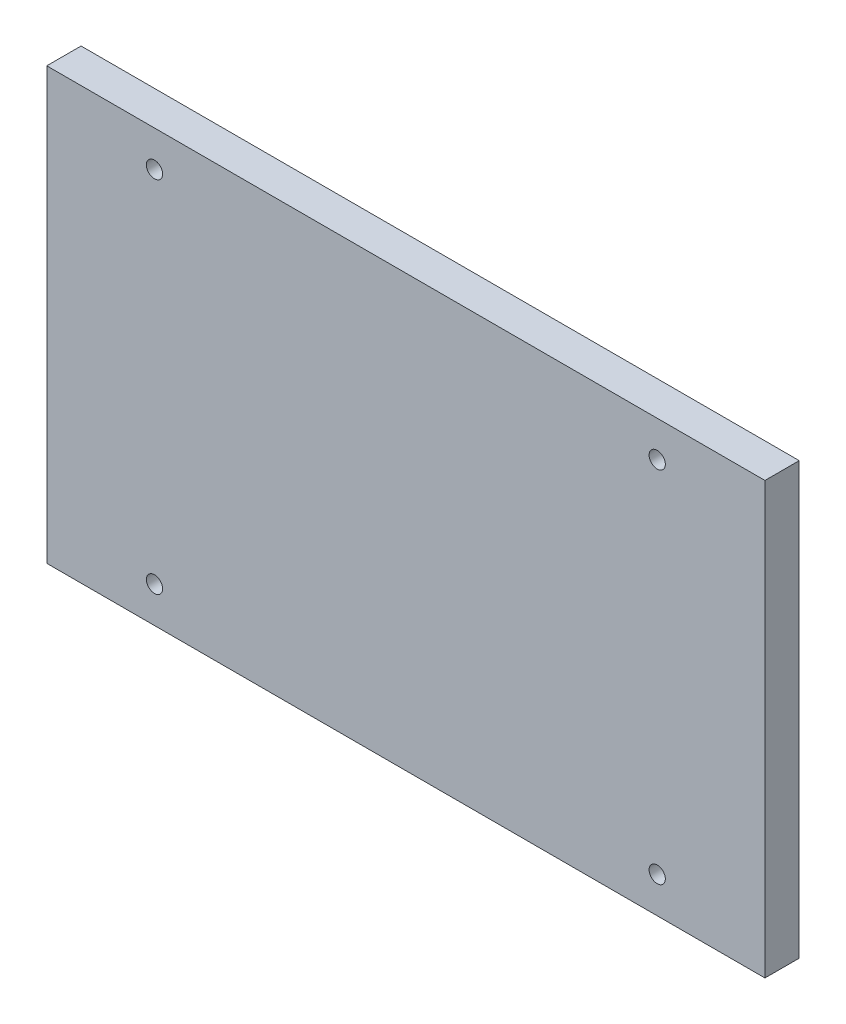
ISO-10303-21;
HEADER;
FILE_DESCRIPTION(('STEP AP214'),'2;1');
FILE_NAME('part.step','',(''),(''),'','','');
FILE_SCHEMA(('AUTOMOTIVE_DESIGN { 1 0 10303 214 1 1 1 1 }'));
ENDSEC;
DATA;
#1=APPLICATION_CONTEXT('core data for automotive mechanical design processes');
#2=APPLICATION_PROTOCOL_DEFINITION('international standard','automotive_design',2000,#1);
#3=PRODUCT_CONTEXT('',#1,'mechanical');
#4=PRODUCT('Part','Part','',(#3));
#5=PRODUCT_RELATED_PRODUCT_CATEGORY('part','',(#4));
#6=PRODUCT_DEFINITION_FORMATION('','',#4);
#7=PRODUCT_DEFINITION_CONTEXT('part definition',#1,'design');
#8=PRODUCT_DEFINITION('design','',#6,#7);
#9=PRODUCT_DEFINITION_SHAPE('','',#8);
#10=(LENGTH_UNIT() NAMED_UNIT(*) SI_UNIT(.MILLI.,.METRE.));
#11=(NAMED_UNIT(*) PLANE_ANGLE_UNIT() SI_UNIT($,.RADIAN.));
#12=(NAMED_UNIT(*) SI_UNIT($,.STERADIAN.) SOLID_ANGLE_UNIT());
#13=UNCERTAINTY_MEASURE_WITH_UNIT(LENGTH_MEASURE(1.E-05),#10,'distance_accuracy_value','');
#14=(GEOMETRIC_REPRESENTATION_CONTEXT(3) GLOBAL_UNCERTAINTY_ASSIGNED_CONTEXT((#13)) GLOBAL_UNIT_ASSIGNED_CONTEXT((#10,
#11,#12)) REPRESENTATION_CONTEXT('',''));
#15=CARTESIAN_POINT('',(0.,0.,0.));
#16=DIRECTION('',(0.,0.,1.));
#17=DIRECTION('',(1.,0.,0.));
#18=AXIS2_PLACEMENT_3D('',#15,#16,#17);
#19=CARTESIAN_POINT('',(100.,0.,4.7752));
#20=DIRECTION('',(1.,0.,0.));
#21=DIRECTION('',(0.,1.,0.));
#22=AXIS2_PLACEMENT_3D('',#19,#20,#21);
#23=PLANE('',#22);
#24=DIRECTION('',(0.,-1.,0.));
#25=VECTOR('',#24,1.);
#26=CARTESIAN_POINT('',(100.,0.,0.));
#27=LINE('',#26,#25);
#28=CARTESIAN_POINT('',(100.,0.,0.));
#29=VERTEX_POINT('',#28);
#30=CARTESIAN_POINT('',(100.,-60.,0.));
#31=VERTEX_POINT('',#30);
#32=EDGE_CURVE('E121',#29,#31,#27,.T.);
#33=ORIENTED_EDGE('',*,*,#32,.F.);
#34=DIRECTION('',(0.,0.,-1.));
#35=VECTOR('',#34,1.);
#36=CARTESIAN_POINT('',(100.,0.,4.7752));
#37=LINE('',#36,#35);
#38=CARTESIAN_POINT('',(100.,0.,4.7752));
#39=VERTEX_POINT('',#38);
#40=EDGE_CURVE('E11',#39,#29,#37,.T.);
#41=ORIENTED_EDGE('',*,*,#40,.F.);
#42=DIRECTION('',(0.,-1.,0.));
#43=VECTOR('',#42,1.);
#44=CARTESIAN_POINT('',(100.,0.,4.7752));
#45=LINE('',#44,#43);
#46=CARTESIAN_POINT('',(100.,-60.,4.7752));
#47=VERTEX_POINT('',#46);
#48=EDGE_CURVE('E112',#39,#47,#45,.T.);
#49=ORIENTED_EDGE('',*,*,#48,.T.);
#50=DIRECTION('',(0.,0.,-1.));
#51=VECTOR('',#50,1.);
#52=CARTESIAN_POINT('',(100.,-60.,4.7752));
#53=LINE('',#52,#51);
#54=EDGE_CURVE('E89',#47,#31,#53,.T.);
#55=ORIENTED_EDGE('',*,*,#54,.T.);
#56=EDGE_LOOP('',(#33,#41,#49,#55));
#57=FACE_BOUND('',#56,.T.);
#58=ADVANCED_FACE('F49',(#57),#23,.T.);
#59=CARTESIAN_POINT('',(0.,0.,4.7752));
#60=DIRECTION('',(0.,1.,0.));
#61=DIRECTION('',(0.,0.,1.));
#62=AXIS2_PLACEMENT_3D('',#59,#60,#61);
#63=PLANE('',#62);
#64=DIRECTION('',(1.,0.,0.));
#65=VECTOR('',#64,1.);
#66=CARTESIAN_POINT('',(0.,0.,0.));
#67=LINE('',#66,#65);
#68=CARTESIAN_POINT('',(0.,0.,0.));
#69=VERTEX_POINT('',#68);
#70=EDGE_CURVE('E101',#69,#29,#67,.T.);
#71=ORIENTED_EDGE('',*,*,#70,.F.);
#72=DIRECTION('',(0.,0.,-1.));
#73=VECTOR('',#72,1.);
#74=CARTESIAN_POINT('',(0.,0.,4.7752));
#75=LINE('',#74,#73);
#76=CARTESIAN_POINT('',(0.,0.,4.7752));
#77=VERTEX_POINT('',#76);
#78=EDGE_CURVE('E58',#77,#69,#75,.T.);
#79=ORIENTED_EDGE('',*,*,#78,.F.);
#80=DIRECTION('',(1.,0.,0.));
#81=VECTOR('',#80,1.);
#82=CARTESIAN_POINT('',(0.,0.,4.7752));
#83=LINE('',#82,#81);
#84=EDGE_CURVE('E99',#77,#39,#83,.T.);
#85=ORIENTED_EDGE('',*,*,#84,.T.);
#86=ORIENTED_EDGE('',*,*,#40,.T.);
#87=EDGE_LOOP('',(#71,#79,#85,#86));
#88=FACE_BOUND('',#87,.T.);
#89=ADVANCED_FACE('F97',(#88),#63,.T.);
#90=CARTESIAN_POINT('',(0.,0.,4.7752));
#91=DIRECTION('',(1.,0.,0.));
#92=DIRECTION('',(0.,1.,0.));
#93=AXIS2_PLACEMENT_3D('',#90,#91,#92);
#94=PLANE('',#93);
#95=DIRECTION('',(0.,-1.,0.));
#96=VECTOR('',#95,1.);
#97=CARTESIAN_POINT('',(0.,0.,0.));
#98=LINE('',#97,#96);
#99=CARTESIAN_POINT('',(0.,-60.,0.));
#100=VERTEX_POINT('',#99);
#101=EDGE_CURVE('E127',#69,#100,#98,.T.);
#102=ORIENTED_EDGE('',*,*,#101,.T.);
#103=DIRECTION('',(0.,0.,-1.));
#104=VECTOR('',#103,1.);
#105=CARTESIAN_POINT('',(0.,-60.,4.7752));
#106=LINE('',#105,#104);
#107=CARTESIAN_POINT('',(0.,-60.,4.7752));
#108=VERTEX_POINT('',#107);
#109=EDGE_CURVE('E105',#108,#100,#106,.T.);
#110=ORIENTED_EDGE('',*,*,#109,.F.);
#111=DIRECTION('',(0.,-1.,0.));
#112=VECTOR('',#111,1.);
#113=CARTESIAN_POINT('',(0.,0.,4.7752));
#114=LINE('',#113,#112);
#115=EDGE_CURVE('E107',#77,#108,#114,.T.);
#116=ORIENTED_EDGE('',*,*,#115,.F.);
#117=ORIENTED_EDGE('',*,*,#78,.T.);
#118=EDGE_LOOP('',(#102,#110,#116,#117));
#119=FACE_BOUND('',#118,.T.);
#120=ADVANCED_FACE('F108',(#119),#94,.F.);
#121=CARTESIAN_POINT('',(0.,-60.,4.7752));
#122=DIRECTION('',(0.,1.,0.));
#123=DIRECTION('',(0.,0.,1.));
#124=AXIS2_PLACEMENT_3D('',#121,#122,#123);
#125=PLANE('',#124);
#126=DIRECTION('',(1.,0.,0.));
#127=VECTOR('',#126,1.);
#128=CARTESIAN_POINT('',(0.,-60.,0.));
#129=LINE('',#128,#127);
#130=EDGE_CURVE('E82',#100,#31,#129,.T.);
#131=ORIENTED_EDGE('',*,*,#130,.T.);
#132=ORIENTED_EDGE('',*,*,#54,.F.);
#133=DIRECTION('',(1.,0.,0.));
#134=VECTOR('',#133,1.);
#135=CARTESIAN_POINT('',(0.,-60.,4.7752));
#136=LINE('',#135,#134);
#137=EDGE_CURVE('E66',#108,#47,#136,.T.);
#138=ORIENTED_EDGE('',*,*,#137,.F.);
#139=ORIENTED_EDGE('',*,*,#109,.T.);
#140=EDGE_LOOP('',(#131,#132,#138,#139));
#141=FACE_BOUND('',#140,.T.);
#142=ADVANCED_FACE('F136',(#141),#125,.F.);
#143=CARTESIAN_POINT('',(0.,0.,4.7752));
#144=DIRECTION('',(0.,0.,1.));
#145=DIRECTION('',(1.,0.,0.));
#146=AXIS2_PLACEMENT_3D('',#143,#144,#145);
#147=PLANE('',#146);
#148=CARTESIAN_POINT('',(15.,-5.,4.7752));
#149=DIRECTION('',(0.,0.,1.));
#150=DIRECTION('',(1.,0.,0.));
#151=AXIS2_PLACEMENT_3D('',#148,#149,#150);
#152=CIRCLE('',#151,1.13029999999999);
#153=CARTESIAN_POINT('',(16.1303,-5.,4.7752));
#154=VERTEX_POINT('',#153);
#155=EDGE_CURVE('E178',#154,#154,#152,.T.);
#156=ORIENTED_EDGE('',*,*,#155,.F.);
#157=EDGE_LOOP('',(#156));
#158=FACE_BOUND('',#157,.T.);
#159=CARTESIAN_POINT('',(15.,-55.,4.7752));
#160=DIRECTION('',(0.,0.,1.));
#161=DIRECTION('',(1.,0.,0.));
#162=AXIS2_PLACEMENT_3D('',#159,#160,#161);
#163=CIRCLE('',#162,1.13029999999999);
#164=CARTESIAN_POINT('',(16.1303,-55.,4.7752));
#165=VERTEX_POINT('',#164);
#166=EDGE_CURVE('E182',#165,#165,#163,.T.);
#167=ORIENTED_EDGE('',*,*,#166,.F.);
#168=EDGE_LOOP('',(#167));
#169=FACE_BOUND('',#168,.T.);
#170=CARTESIAN_POINT('',(85.,-55.,4.7752));
#171=DIRECTION('',(0.,0.,1.));
#172=DIRECTION('',(1.,0.,0.));
#173=AXIS2_PLACEMENT_3D('',#170,#171,#172);
#174=CIRCLE('',#173,1.13029999999999);
#175=CARTESIAN_POINT('',(86.1303,-55.,4.7752));
#176=VERTEX_POINT('',#175);
#177=EDGE_CURVE('E192',#176,#176,#174,.T.);
#178=ORIENTED_EDGE('',*,*,#177,.F.);
#179=EDGE_LOOP('',(#178));
#180=FACE_BOUND('',#179,.T.);
#181=CARTESIAN_POINT('',(85.,-5.,4.7752));
#182=DIRECTION('',(0.,0.,1.));
#183=DIRECTION('',(1.,0.,0.));
#184=AXIS2_PLACEMENT_3D('',#181,#182,#183);
#185=CIRCLE('',#184,1.13029999999999);
#186=CARTESIAN_POINT('',(86.1303,-5.,4.7752));
#187=VERTEX_POINT('',#186);
#188=EDGE_CURVE('E200',#187,#187,#185,.T.);
#189=ORIENTED_EDGE('',*,*,#188,.F.);
#190=EDGE_LOOP('',(#189));
#191=FACE_BOUND('',#190,.T.);
#192=ORIENTED_EDGE('',*,*,#48,.F.);
#193=ORIENTED_EDGE('',*,*,#84,.F.);
#194=ORIENTED_EDGE('',*,*,#115,.T.);
#195=ORIENTED_EDGE('',*,*,#137,.T.);
#196=EDGE_LOOP('',(#192,#193,#194,#195));
#197=FACE_BOUND('',#196,.T.);
#198=ADVANCED_FACE('F111',(#158,#169,#180,#191,#197),#147,.T.);
#199=CARTESIAN_POINT('',(0.,0.,0.));
#200=DIRECTION('',(0.,0.,1.));
#201=DIRECTION('',(1.,0.,0.));
#202=AXIS2_PLACEMENT_3D('',#199,#200,#201);
#203=PLANE('',#202);
#204=CARTESIAN_POINT('',(15.,-5.,0.));
#205=DIRECTION('',(0.,0.,1.));
#206=DIRECTION('',(1.,0.,0.));
#207=AXIS2_PLACEMENT_3D('',#204,#205,#206);
#208=CIRCLE('',#207,1.1303);
#209=CARTESIAN_POINT('',(16.1303,-5.,0.));
#210=VERTEX_POINT('',#209);
#211=EDGE_CURVE('E175',#210,#210,#208,.T.);
#212=ORIENTED_EDGE('',*,*,#211,.T.);
#213=EDGE_LOOP('',(#212));
#214=FACE_BOUND('',#213,.T.);
#215=CARTESIAN_POINT('',(15.,-55.,0.));
#216=DIRECTION('',(0.,0.,1.));
#217=DIRECTION('',(1.,0.,0.));
#218=AXIS2_PLACEMENT_3D('',#215,#216,#217);
#219=CIRCLE('',#218,1.1303);
#220=CARTESIAN_POINT('',(16.1303,-55.,0.));
#221=VERTEX_POINT('',#220);
#222=EDGE_CURVE('E188',#221,#221,#219,.T.);
#223=ORIENTED_EDGE('',*,*,#222,.T.);
#224=EDGE_LOOP('',(#223));
#225=FACE_BOUND('',#224,.T.);
#226=CARTESIAN_POINT('',(85.,-55.,0.));
#227=DIRECTION('',(0.,0.,1.));
#228=DIRECTION('',(1.,0.,0.));
#229=AXIS2_PLACEMENT_3D('',#226,#227,#228);
#230=CIRCLE('',#229,1.1303);
#231=CARTESIAN_POINT('',(86.1303,-55.,0.));
#232=VERTEX_POINT('',#231);
#233=EDGE_CURVE('E196',#232,#232,#230,.T.);
#234=ORIENTED_EDGE('',*,*,#233,.T.);
#235=EDGE_LOOP('',(#234));
#236=FACE_BOUND('',#235,.T.);
#237=CARTESIAN_POINT('',(85.,-5.,0.));
#238=DIRECTION('',(0.,0.,1.));
#239=DIRECTION('',(1.,0.,0.));
#240=AXIS2_PLACEMENT_3D('',#237,#238,#239);
#241=CIRCLE('',#240,1.1303);
#242=CARTESIAN_POINT('',(86.1303,-5.,0.));
#243=VERTEX_POINT('',#242);
#244=EDGE_CURVE('E124',#243,#243,#241,.T.);
#245=ORIENTED_EDGE('',*,*,#244,.T.);
#246=EDGE_LOOP('',(#245));
#247=FACE_BOUND('',#246,.T.);
#248=ORIENTED_EDGE('',*,*,#32,.T.);
#249=ORIENTED_EDGE('',*,*,#130,.F.);
#250=ORIENTED_EDGE('',*,*,#101,.F.);
#251=ORIENTED_EDGE('',*,*,#70,.T.);
#252=EDGE_LOOP('',(#248,#249,#250,#251));
#253=FACE_BOUND('',#252,.T.);
#254=ADVANCED_FACE('F137',(#214,#225,#236,#247,#253),#203,.F.);
#255=CARTESIAN_POINT('',(85.,-5.,4.7752));
#256=DIRECTION('',(0.,0.,1.));
#257=DIRECTION('',(1.,0.,0.));
#258=AXIS2_PLACEMENT_3D('',#255,#256,#257);
#259=CYLINDRICAL_SURFACE('',#258,1.13029999999999);
#260=ORIENTED_EDGE('',*,*,#244,.F.);
#261=EDGE_LOOP('',(#260));
#262=FACE_BOUND('',#261,.T.);
#263=ORIENTED_EDGE('',*,*,#188,.T.);
#264=EDGE_LOOP('',(#263));
#265=FACE_BOUND('',#264,.T.);
#266=ADVANCED_FACE('F151',(#262,#265),#259,.F.);
#267=CARTESIAN_POINT('',(85.,-55.,4.7752));
#268=DIRECTION('',(0.,0.,1.));
#269=DIRECTION('',(1.,0.,0.));
#270=AXIS2_PLACEMENT_3D('',#267,#268,#269);
#271=CYLINDRICAL_SURFACE('',#270,1.13029999999999);
#272=ORIENTED_EDGE('',*,*,#233,.F.);
#273=EDGE_LOOP('',(#272));
#274=FACE_BOUND('',#273,.T.);
#275=ORIENTED_EDGE('',*,*,#177,.T.);
#276=EDGE_LOOP('',(#275));
#277=FACE_BOUND('',#276,.T.);
#278=ADVANCED_FACE('F158',(#274,#277),#271,.F.);
#279=CARTESIAN_POINT('',(15.,-55.,4.7752));
#280=DIRECTION('',(0.,0.,1.));
#281=DIRECTION('',(1.,0.,0.));
#282=AXIS2_PLACEMENT_3D('',#279,#280,#281);
#283=CYLINDRICAL_SURFACE('',#282,1.13029999999999);
#284=ORIENTED_EDGE('',*,*,#222,.F.);
#285=EDGE_LOOP('',(#284));
#286=FACE_BOUND('',#285,.T.);
#287=ORIENTED_EDGE('',*,*,#166,.T.);
#288=EDGE_LOOP('',(#287));
#289=FACE_BOUND('',#288,.T.);
#290=ADVANCED_FACE('F162',(#286,#289),#283,.F.);
#291=CARTESIAN_POINT('',(15.,-5.,4.7752));
#292=DIRECTION('',(0.,0.,1.));
#293=DIRECTION('',(1.,0.,0.));
#294=AXIS2_PLACEMENT_3D('',#291,#292,#293);
#295=CYLINDRICAL_SURFACE('',#294,1.13029999999999);
#296=ORIENTED_EDGE('',*,*,#211,.F.);
#297=EDGE_LOOP('',(#296));
#298=FACE_BOUND('',#297,.T.);
#299=ORIENTED_EDGE('',*,*,#155,.T.);
#300=EDGE_LOOP('',(#299));
#301=FACE_BOUND('',#300,.T.);
#302=ADVANCED_FACE('F166',(#298,#301),#295,.F.);
#303=CLOSED_SHELL('',(#58,#89,#120,#142,#198,#254,#266,#278,#290,#302));
#304=MANIFOLD_SOLID_BREP('B2',#303);
#305=ADVANCED_BREP_SHAPE_REPRESENTATION('',(#18,#304),#14);
#306=SHAPE_DEFINITION_REPRESENTATION(#9,#305);
ENDSEC;
END-ISO-10303-21;
